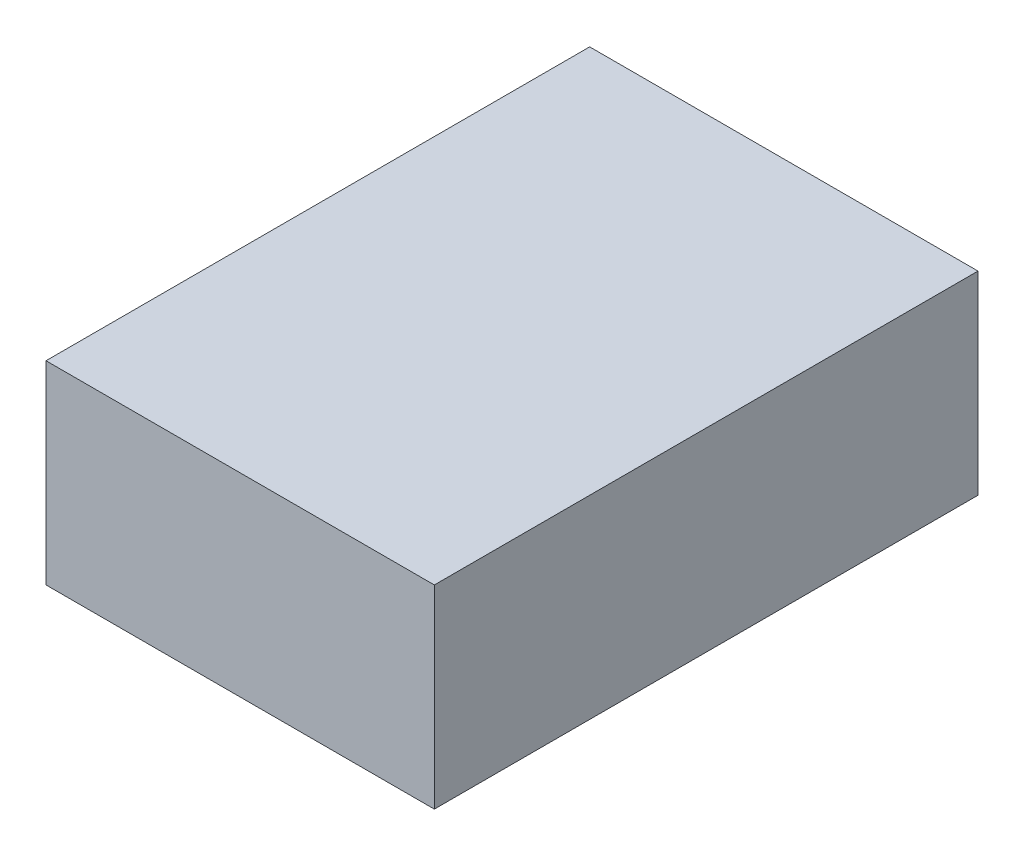
ISO-10303-21;
HEADER;
FILE_DESCRIPTION(('STEP AP214'),'2;1');
FILE_NAME('part.step','',(''),(''),'','','');
FILE_SCHEMA(('AUTOMOTIVE_DESIGN { 1 0 10303 214 1 1 1 1 }'));
ENDSEC;
DATA;
#1=APPLICATION_CONTEXT('core data for automotive mechanical design processes');
#2=APPLICATION_PROTOCOL_DEFINITION('international standard','automotive_design',2000,#1);
#3=PRODUCT_CONTEXT('',#1,'mechanical');
#4=PRODUCT('Part','Part','',(#3));
#5=PRODUCT_RELATED_PRODUCT_CATEGORY('part','',(#4));
#6=PRODUCT_DEFINITION_FORMATION('','',#4);
#7=PRODUCT_DEFINITION_CONTEXT('part definition',#1,'design');
#8=PRODUCT_DEFINITION('design','',#6,#7);
#9=PRODUCT_DEFINITION_SHAPE('','',#8);
#10=(LENGTH_UNIT() NAMED_UNIT(*) SI_UNIT(.MILLI.,.METRE.));
#11=(NAMED_UNIT(*) PLANE_ANGLE_UNIT() SI_UNIT($,.RADIAN.));
#12=(NAMED_UNIT(*) SI_UNIT($,.STERADIAN.) SOLID_ANGLE_UNIT());
#13=UNCERTAINTY_MEASURE_WITH_UNIT(LENGTH_MEASURE(1.E-05),#10,'distance_accuracy_value','');
#14=(GEOMETRIC_REPRESENTATION_CONTEXT(3) GLOBAL_UNCERTAINTY_ASSIGNED_CONTEXT((#13)) GLOBAL_UNIT_ASSIGNED_CONTEXT((#10,
#11,#12)) REPRESENTATION_CONTEXT('',''));
#15=CARTESIAN_POINT('',(0.,0.,0.));
#16=DIRECTION('',(0.,0.,1.));
#17=DIRECTION('',(1.,0.,0.));
#18=AXIS2_PLACEMENT_3D('',#15,#16,#17);
#19=CARTESIAN_POINT('',(0.,0.,177.8));
#20=DIRECTION('',(1.,0.,0.));
#21=DIRECTION('',(0.,0.,-1.));
#22=AXIS2_PLACEMENT_3D('',#19,#20,#21);
#23=PLANE('',#22);
#24=DIRECTION('',(0.,-1.,0.));
#25=VECTOR('',#24,1.);
#26=CARTESIAN_POINT('',(0.,0.,0.));
#27=LINE('',#26,#25);
#28=CARTESIAN_POINT('',(0.,63.5,0.));
#29=VERTEX_POINT('',#28);
#30=CARTESIAN_POINT('',(0.,0.,0.));
#31=VERTEX_POINT('',#30);
#32=EDGE_CURVE('E97',#29,#31,#27,.T.);
#33=ORIENTED_EDGE('',*,*,#32,.T.);
#34=DIRECTION('',(0.,0.,-1.));
#35=VECTOR('',#34,1.);
#36=CARTESIAN_POINT('',(0.,0.,177.8));
#37=LINE('',#36,#35);
#38=CARTESIAN_POINT('',(0.,0.,177.8));
#39=VERTEX_POINT('',#38);
#40=EDGE_CURVE('E11',#39,#31,#37,.T.);
#41=ORIENTED_EDGE('',*,*,#40,.F.);
#42=DIRECTION('',(0.,-1.,0.));
#43=VECTOR('',#42,1.);
#44=CARTESIAN_POINT('',(0.,0.,177.8));
#45=LINE('',#44,#43);
#46=CARTESIAN_POINT('',(0.,63.5,177.8));
#47=VERTEX_POINT('',#46);
#48=EDGE_CURVE('E85',#47,#39,#45,.T.);
#49=ORIENTED_EDGE('',*,*,#48,.F.);
#50=DIRECTION('',(0.,0.,-1.));
#51=VECTOR('',#50,1.);
#52=CARTESIAN_POINT('',(0.,63.5,177.8));
#53=LINE('',#52,#51);
#54=EDGE_CURVE('E93',#47,#29,#53,.T.);
#55=ORIENTED_EDGE('',*,*,#54,.T.);
#56=EDGE_LOOP('',(#33,#41,#49,#55));
#57=FACE_BOUND('',#56,.T.);
#58=ADVANCED_FACE('F34',(#57),#23,.F.);
#59=CARTESIAN_POINT('',(0.,0.,177.8));
#60=DIRECTION('',(0.,1.,0.));
#61=DIRECTION('',(0.,0.,1.));
#62=AXIS2_PLACEMENT_3D('',#59,#60,#61);
#63=PLANE('',#62);
#64=DIRECTION('',(1.,0.,0.));
#65=VECTOR('',#64,1.);
#66=CARTESIAN_POINT('',(0.,0.,0.));
#67=LINE('',#66,#65);
#68=CARTESIAN_POINT('',(127.,0.,0.));
#69=VERTEX_POINT('',#68);
#70=EDGE_CURVE('E89',#31,#69,#67,.T.);
#71=ORIENTED_EDGE('',*,*,#70,.T.);
#72=DIRECTION('',(0.,0.,-1.));
#73=VECTOR('',#72,1.);
#74=CARTESIAN_POINT('',(127.,0.,177.8));
#75=LINE('',#74,#73);
#76=CARTESIAN_POINT('',(127.,0.,177.8));
#77=VERTEX_POINT('',#76);
#78=EDGE_CURVE('E42',#77,#69,#75,.T.);
#79=ORIENTED_EDGE('',*,*,#78,.F.);
#80=DIRECTION('',(1.,0.,0.));
#81=VECTOR('',#80,1.);
#82=CARTESIAN_POINT('',(0.,0.,177.8));
#83=LINE('',#82,#81);
#84=EDGE_CURVE('E80',#39,#77,#83,.T.);
#85=ORIENTED_EDGE('',*,*,#84,.F.);
#86=ORIENTED_EDGE('',*,*,#40,.T.);
#87=EDGE_LOOP('',(#71,#79,#85,#86));
#88=FACE_BOUND('',#87,.T.);
#89=ADVANCED_FACE('F88',(#88),#63,.F.);
#90=CARTESIAN_POINT('',(127.,0.,177.8));
#91=DIRECTION('',(-1.,0.,0.));
#92=DIRECTION('',(0.,0.,1.));
#93=AXIS2_PLACEMENT_3D('',#90,#91,#92);
#94=PLANE('',#93);
#95=DIRECTION('',(0.,1.,0.));
#96=VECTOR('',#95,1.);
#97=CARTESIAN_POINT('',(127.,0.,0.));
#98=LINE('',#97,#96);
#99=CARTESIAN_POINT('',(127.,63.5,0.));
#100=VERTEX_POINT('',#99);
#101=EDGE_CURVE('E67',#69,#100,#98,.T.);
#102=ORIENTED_EDGE('',*,*,#101,.T.);
#103=DIRECTION('',(0.,0.,-1.));
#104=VECTOR('',#103,1.);
#105=CARTESIAN_POINT('',(127.,63.5,177.8));
#106=LINE('',#105,#104);
#107=CARTESIAN_POINT('',(127.,63.5,177.8));
#108=VERTEX_POINT('',#107);
#109=EDGE_CURVE('E90',#108,#100,#106,.T.);
#110=ORIENTED_EDGE('',*,*,#109,.F.);
#111=DIRECTION('',(0.,1.,0.));
#112=VECTOR('',#111,1.);
#113=CARTESIAN_POINT('',(127.,0.,177.8));
#114=LINE('',#113,#112);
#115=EDGE_CURVE('E83',#77,#108,#114,.T.);
#116=ORIENTED_EDGE('',*,*,#115,.F.);
#117=ORIENTED_EDGE('',*,*,#78,.T.);
#118=EDGE_LOOP('',(#102,#110,#116,#117));
#119=FACE_BOUND('',#118,.T.);
#120=ADVANCED_FACE('F91',(#119),#94,.F.);
#121=CARTESIAN_POINT('',(0.,63.5,177.8));
#122=DIRECTION('',(0.,-1.,0.));
#123=DIRECTION('',(0.,0.,-1.));
#124=AXIS2_PLACEMENT_3D('',#121,#122,#123);
#125=PLANE('',#124);
#126=DIRECTION('',(-1.,0.,0.));
#127=VECTOR('',#126,1.);
#128=CARTESIAN_POINT('',(0.,63.5,0.));
#129=LINE('',#128,#127);
#130=EDGE_CURVE('E73',#100,#29,#129,.T.);
#131=ORIENTED_EDGE('',*,*,#130,.T.);
#132=ORIENTED_EDGE('',*,*,#54,.F.);
#133=DIRECTION('',(-1.,0.,0.));
#134=VECTOR('',#133,1.);
#135=CARTESIAN_POINT('',(0.,63.5,177.8));
#136=LINE('',#135,#134);
#137=EDGE_CURVE('E50',#108,#47,#136,.T.);
#138=ORIENTED_EDGE('',*,*,#137,.F.);
#139=ORIENTED_EDGE('',*,*,#109,.T.);
#140=EDGE_LOOP('',(#131,#132,#138,#139));
#141=FACE_BOUND('',#140,.T.);
#142=ADVANCED_FACE('F104',(#141),#125,.F.);
#143=CARTESIAN_POINT('',(0.,0.,177.8));
#144=DIRECTION('',(0.,0.,-1.));
#145=DIRECTION('',(-1.,0.,0.));
#146=AXIS2_PLACEMENT_3D('',#143,#144,#145);
#147=PLANE('',#146);
#148=ORIENTED_EDGE('',*,*,#48,.T.);
#149=ORIENTED_EDGE('',*,*,#84,.T.);
#150=ORIENTED_EDGE('',*,*,#115,.T.);
#151=ORIENTED_EDGE('',*,*,#137,.T.);
#152=EDGE_LOOP('',(#148,#149,#150,#151));
#153=FACE_BOUND('',#152,.T.);
#154=ADVANCED_FACE('F81',(#153),#147,.F.);
#155=CARTESIAN_POINT('',(0.,0.,0.));
#156=DIRECTION('',(0.,0.,-1.));
#157=DIRECTION('',(-1.,0.,0.));
#158=AXIS2_PLACEMENT_3D('',#155,#156,#157);
#159=PLANE('',#158);
#160=ORIENTED_EDGE('',*,*,#32,.F.);
#161=ORIENTED_EDGE('',*,*,#130,.F.);
#162=ORIENTED_EDGE('',*,*,#101,.F.);
#163=ORIENTED_EDGE('',*,*,#70,.F.);
#164=EDGE_LOOP('',(#160,#161,#162,#163));
#165=FACE_BOUND('',#164,.T.);
#166=ADVANCED_FACE('F107',(#165),#159,.T.);
#167=CLOSED_SHELL('',(#58,#89,#120,#142,#154,#166));
#168=MANIFOLD_SOLID_BREP('B2',#167);
#169=ADVANCED_BREP_SHAPE_REPRESENTATION('',(#18,#168),#14);
#170=SHAPE_DEFINITION_REPRESENTATION(#9,#169);
ENDSEC;
END-ISO-10303-21;
